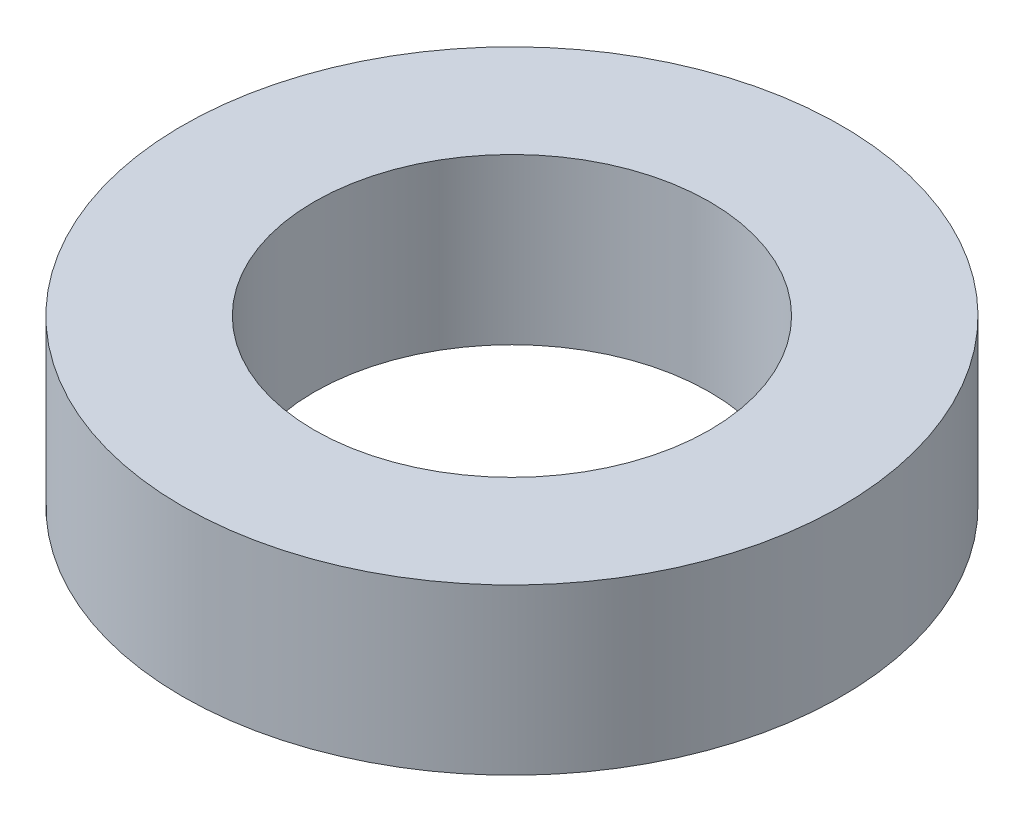
ISO-10303-21;
HEADER;
FILE_DESCRIPTION(('STEP AP214'),'2;1');
FILE_NAME('part.step','',(''),(''),'','','');
FILE_SCHEMA(('AUTOMOTIVE_DESIGN { 1 0 10303 214 1 1 1 1 }'));
ENDSEC;
DATA;
#1=APPLICATION_CONTEXT('core data for automotive mechanical design processes');
#2=APPLICATION_PROTOCOL_DEFINITION('international standard','automotive_design',2000,#1);
#3=PRODUCT_CONTEXT('',#1,'mechanical');
#4=PRODUCT('Part','Part','',(#3));
#5=PRODUCT_RELATED_PRODUCT_CATEGORY('part','',(#4));
#6=PRODUCT_DEFINITION_FORMATION('','',#4);
#7=PRODUCT_DEFINITION_CONTEXT('part definition',#1,'design');
#8=PRODUCT_DEFINITION('design','',#6,#7);
#9=PRODUCT_DEFINITION_SHAPE('','',#8);
#10=(LENGTH_UNIT() NAMED_UNIT(*) SI_UNIT(.MILLI.,.METRE.));
#11=(NAMED_UNIT(*) PLANE_ANGLE_UNIT() SI_UNIT($,.RADIAN.));
#12=(NAMED_UNIT(*) SI_UNIT($,.STERADIAN.) SOLID_ANGLE_UNIT());
#13=UNCERTAINTY_MEASURE_WITH_UNIT(LENGTH_MEASURE(1.E-05),#10,'distance_accuracy_value','');
#14=(GEOMETRIC_REPRESENTATION_CONTEXT(3) GLOBAL_UNCERTAINTY_ASSIGNED_CONTEXT((#13)) GLOBAL_UNIT_ASSIGNED_CONTEXT((#10,
#11,#12)) REPRESENTATION_CONTEXT('',''));
#15=CARTESIAN_POINT('',(0.,0.,0.));
#16=DIRECTION('',(0.,0.,1.));
#17=DIRECTION('',(1.,0.,0.));
#18=AXIS2_PLACEMENT_3D('',#15,#16,#17);
#19=CARTESIAN_POINT('',(0.,3.175,0.));
#20=DIRECTION('',(0.,1.,0.));
#21=DIRECTION('',(0.,0.,1.));
#22=AXIS2_PLACEMENT_3D('',#19,#20,#21);
#23=PLANE('',#22);
#24=CARTESIAN_POINT('',(0.,3.175,0.));
#25=DIRECTION('',(0.,1.,0.));
#26=DIRECTION('',(0.,0.,1.));
#27=AXIS2_PLACEMENT_3D('',#24,#25,#26);
#28=CIRCLE('',#27,6.35);
#29=CARTESIAN_POINT('',(0.,3.175,6.35));
#30=VERTEX_POINT('',#29);
#31=EDGE_CURVE('E10',#30,#30,#28,.T.);
#32=ORIENTED_EDGE('',*,*,#31,.T.);
#33=EDGE_LOOP('',(#32));
#34=FACE_BOUND('',#33,.T.);
#35=CARTESIAN_POINT('',(0.,3.175,0.));
#36=DIRECTION('',(0.,1.,0.));
#37=DIRECTION('',(0.,0.,1.));
#38=AXIS2_PLACEMENT_3D('',#35,#36,#37);
#39=CIRCLE('',#38,3.81);
#40=CARTESIAN_POINT('',(0.,3.175,3.81));
#41=VERTEX_POINT('',#40);
#42=EDGE_CURVE('E42',#41,#41,#39,.T.);
#43=ORIENTED_EDGE('',*,*,#42,.F.);
#44=EDGE_LOOP('',(#43));
#45=FACE_BOUND('',#44,.T.);
#46=ADVANCED_FACE('F31',(#34,#45),#23,.T.);
#47=CARTESIAN_POINT('',(0.,0.,0.));
#48=DIRECTION('',(0.,1.,0.));
#49=DIRECTION('',(0.,0.,1.));
#50=AXIS2_PLACEMENT_3D('',#47,#48,#49);
#51=PLANE('',#50);
#52=CARTESIAN_POINT('',(0.,0.,0.));
#53=DIRECTION('',(0.,1.,0.));
#54=DIRECTION('',(0.,0.,1.));
#55=AXIS2_PLACEMENT_3D('',#52,#53,#54);
#56=CIRCLE('',#55,6.35);
#57=CARTESIAN_POINT('',(0.,0.,6.35));
#58=VERTEX_POINT('',#57);
#59=EDGE_CURVE('E35',#58,#58,#56,.T.);
#60=ORIENTED_EDGE('',*,*,#59,.F.);
#61=EDGE_LOOP('',(#60));
#62=FACE_BOUND('',#61,.T.);
#63=CARTESIAN_POINT('',(0.,0.,0.));
#64=DIRECTION('',(0.,1.,0.));
#65=DIRECTION('',(0.,0.,1.));
#66=AXIS2_PLACEMENT_3D('',#63,#64,#65);
#67=CIRCLE('',#66,3.81);
#68=CARTESIAN_POINT('',(0.,0.,3.81));
#69=VERTEX_POINT('',#68);
#70=EDGE_CURVE('E44',#69,#69,#67,.T.);
#71=ORIENTED_EDGE('',*,*,#70,.T.);
#72=EDGE_LOOP('',(#71));
#73=FACE_BOUND('',#72,.T.);
#74=ADVANCED_FACE('F54',(#62,#73),#51,.F.);
#75=CARTESIAN_POINT('',(0.,3.175,0.));
#76=DIRECTION('',(0.,-1.,0.));
#77=DIRECTION('',(0.,0.,-1.));
#78=AXIS2_PLACEMENT_3D('',#75,#76,#77);
#79=CYLINDRICAL_SURFACE('',#78,6.35);
#80=ORIENTED_EDGE('',*,*,#31,.F.);
#81=EDGE_LOOP('',(#80));
#82=FACE_BOUND('',#81,.T.);
#83=ORIENTED_EDGE('',*,*,#59,.T.);
#84=EDGE_LOOP('',(#83));
#85=FACE_BOUND('',#84,.T.);
#86=ADVANCED_FACE('F33',(#82,#85),#79,.T.);
#87=CARTESIAN_POINT('',(0.,3.175,0.));
#88=DIRECTION('',(0.,-1.,0.));
#89=DIRECTION('',(0.,0.,-1.));
#90=AXIS2_PLACEMENT_3D('',#87,#88,#89);
#91=CYLINDRICAL_SURFACE('',#90,3.81);
#92=ORIENTED_EDGE('',*,*,#42,.T.);
#93=EDGE_LOOP('',(#92));
#94=FACE_BOUND('',#93,.T.);
#95=ORIENTED_EDGE('',*,*,#70,.F.);
#96=EDGE_LOOP('',(#95));
#97=FACE_BOUND('',#96,.T.);
#98=ADVANCED_FACE('F50',(#94,#97),#91,.F.);
#99=CLOSED_SHELL('',(#46,#74,#86,#98));
#100=MANIFOLD_SOLID_BREP('B2',#99);
#101=ADVANCED_BREP_SHAPE_REPRESENTATION('',(#18,#100),#14);
#102=SHAPE_DEFINITION_REPRESENTATION(#9,#101);
ENDSEC;
END-ISO-10303-21;
